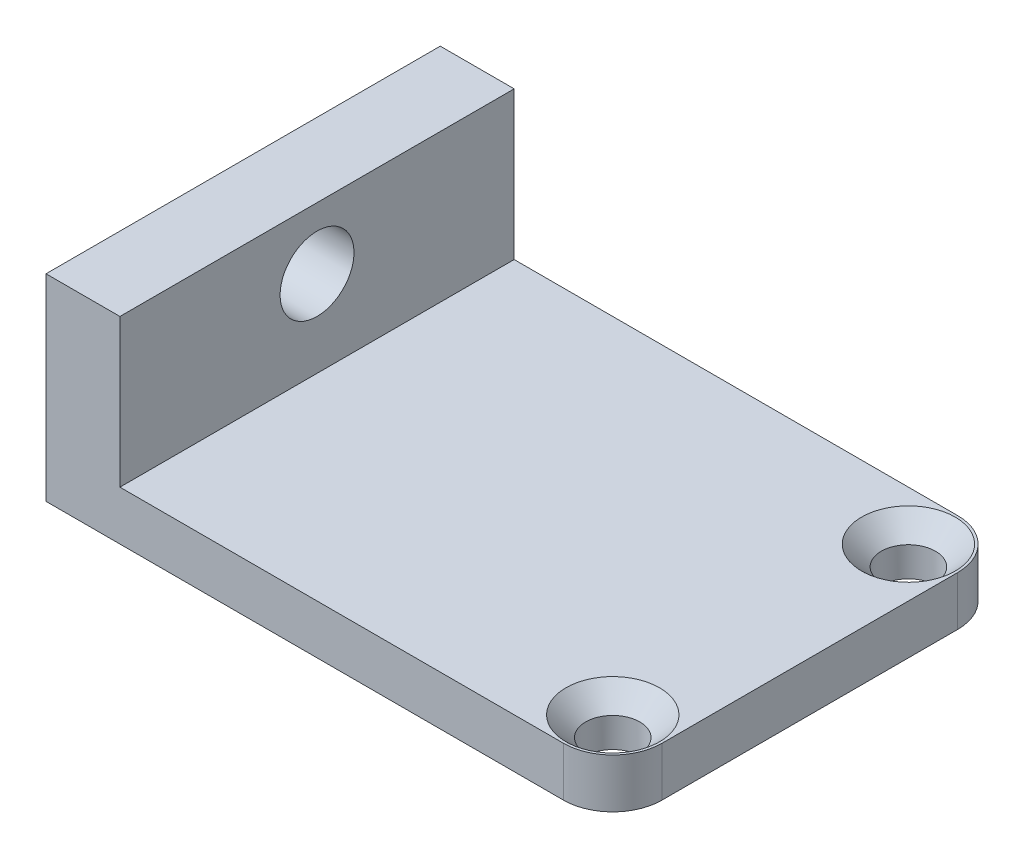
ISO-10303-21;
HEADER;
FILE_DESCRIPTION(('STEP AP214'),'2;1');
FILE_NAME('part.step','',(''),(''),'','','');
FILE_SCHEMA(('AUTOMOTIVE_DESIGN { 1 0 10303 214 1 1 1 1 }'));
ENDSEC;
DATA;
#1=APPLICATION_CONTEXT('core data for automotive mechanical design processes');
#2=APPLICATION_PROTOCOL_DEFINITION('international standard','automotive_design',2000,#1);
#3=PRODUCT_CONTEXT('',#1,'mechanical');
#4=PRODUCT('Part','Part','',(#3));
#5=PRODUCT_RELATED_PRODUCT_CATEGORY('part','',(#4));
#6=PRODUCT_DEFINITION_FORMATION('','',#4);
#7=PRODUCT_DEFINITION_CONTEXT('part definition',#1,'design');
#8=PRODUCT_DEFINITION('design','',#6,#7);
#9=PRODUCT_DEFINITION_SHAPE('','',#8);
#10=(LENGTH_UNIT() NAMED_UNIT(*) SI_UNIT(.MILLI.,.METRE.));
#11=(NAMED_UNIT(*) PLANE_ANGLE_UNIT() SI_UNIT($,.RADIAN.));
#12=(NAMED_UNIT(*) SI_UNIT($,.STERADIAN.) SOLID_ANGLE_UNIT());
#13=UNCERTAINTY_MEASURE_WITH_UNIT(LENGTH_MEASURE(1.E-05),#10,'distance_accuracy_value','');
#14=(GEOMETRIC_REPRESENTATION_CONTEXT(3) GLOBAL_UNCERTAINTY_ASSIGNED_CONTEXT((#13)) GLOBAL_UNIT_ASSIGNED_CONTEXT((#10,
#11,#12)) REPRESENTATION_CONTEXT('',''));
#15=CARTESIAN_POINT('',(0.,0.,0.));
#16=DIRECTION('',(0.,0.,1.));
#17=DIRECTION('',(1.,0.,0.));
#18=AXIS2_PLACEMENT_3D('',#15,#16,#17);
#19=CARTESIAN_POINT('',(23.,0.,16.));
#20=DIRECTION('',(0.,1.,0.));
#21=DIRECTION('',(0.,0.,1.));
#22=AXIS2_PLACEMENT_3D('',#19,#20,#21);
#23=PLANE('',#22);
#24=CARTESIAN_POINT('',(21.,0.,2.));
#25=DIRECTION('',(0.,1.,0.));
#26=DIRECTION('',(0.,0.,1.));
#27=AXIS2_PLACEMENT_3D('',#24,#25,#26);
#28=CIRCLE('',#27,1.1);
#29=CARTESIAN_POINT('',(21.,0.,3.1));
#30=VERTEX_POINT('',#29);
#31=EDGE_CURVE('E133',#30,#30,#28,.T.);
#32=ORIENTED_EDGE('',*,*,#31,.T.);
#33=EDGE_LOOP('',(#32));
#34=FACE_BOUND('',#33,.T.);
#35=CARTESIAN_POINT('',(21.,0.,14.));
#36=DIRECTION('',(0.,1.,0.));
#37=DIRECTION('',(0.,0.,1.));
#38=AXIS2_PLACEMENT_3D('',#35,#36,#37);
#39=CIRCLE('',#38,1.1);
#40=CARTESIAN_POINT('',(21.,0.,15.1));
#41=VERTEX_POINT('',#40);
#42=EDGE_CURVE('E332',#41,#41,#39,.T.);
#43=ORIENTED_EDGE('',*,*,#42,.T.);
#44=EDGE_LOOP('',(#43));
#45=FACE_BOUND('',#44,.T.);
#46=DIRECTION('',(0.,0.,-1.));
#47=VECTOR('',#46,1.);
#48=CARTESIAN_POINT('',(23.,0.,16.));
#49=LINE('',#48,#47);
#50=CARTESIAN_POINT('',(23.,0.,14.));
#51=VERTEX_POINT('',#50);
#52=CARTESIAN_POINT('',(23.,0.,2.));
#53=VERTEX_POINT('',#52);
#54=EDGE_CURVE('E149',#51,#53,#49,.T.);
#55=ORIENTED_EDGE('',*,*,#54,.F.);
#56=CARTESIAN_POINT('',(21.,0.,14.));
#57=DIRECTION('',(0.,1.,0.));
#58=DIRECTION('',(0.,0.,1.));
#59=AXIS2_PLACEMENT_3D('',#56,#57,#58);
#60=CIRCLE('',#59,2.);
#61=CARTESIAN_POINT('',(21.,0.,16.));
#62=VERTEX_POINT('',#61);
#63=EDGE_CURVE('E41',#51,#62,#60,.F.);
#64=ORIENTED_EDGE('',*,*,#63,.T.);
#65=DIRECTION('',(1.,0.,0.));
#66=VECTOR('',#65,1.);
#67=CARTESIAN_POINT('',(23.,0.,16.));
#68=LINE('',#67,#66);
#69=CARTESIAN_POINT('',(0.,0.,16.));
#70=VERTEX_POINT('',#69);
#71=EDGE_CURVE('E109',#70,#62,#68,.T.);
#72=ORIENTED_EDGE('',*,*,#71,.F.);
#73=DIRECTION('',(0.,0.,-1.));
#74=VECTOR('',#73,1.);
#75=CARTESIAN_POINT('',(0.,0.,16.));
#76=LINE('',#75,#74);
#77=CARTESIAN_POINT('',(0.,0.,0.));
#78=VERTEX_POINT('',#77);
#79=EDGE_CURVE('E130',#70,#78,#76,.T.);
#80=ORIENTED_EDGE('',*,*,#79,.T.);
#81=DIRECTION('',(1.,0.,0.));
#82=VECTOR('',#81,1.);
#83=CARTESIAN_POINT('',(23.,0.,0.));
#84=LINE('',#83,#82);
#85=CARTESIAN_POINT('',(21.,0.,0.));
#86=VERTEX_POINT('',#85);
#87=EDGE_CURVE('E131',#78,#86,#84,.T.);
#88=ORIENTED_EDGE('',*,*,#87,.T.);
#89=CARTESIAN_POINT('',(21.,0.,2.));
#90=DIRECTION('',(0.,1.,0.));
#91=DIRECTION('',(0.,0.,1.));
#92=AXIS2_PLACEMENT_3D('',#89,#90,#91);
#93=CIRCLE('',#92,2.);
#94=EDGE_CURVE('E53',#86,#53,#93,.F.);
#95=ORIENTED_EDGE('',*,*,#94,.T.);
#96=EDGE_LOOP('',(#55,#64,#72,#80,#88,#95));
#97=FACE_BOUND('',#96,.T.);
#98=ADVANCED_FACE('F33',(#34,#45,#97),#23,.F.);
#99=CARTESIAN_POINT('',(23.,2.,16.));
#100=DIRECTION('',(-1.,0.,0.));
#101=DIRECTION('',(0.,0.,1.));
#102=AXIS2_PLACEMENT_3D('',#99,#100,#101);
#103=PLANE('',#102);
#104=DIRECTION('',(0.,0.,-1.));
#105=VECTOR('',#104,1.);
#106=CARTESIAN_POINT('',(23.,2.,16.));
#107=LINE('',#106,#105);
#108=CARTESIAN_POINT('',(23.,2.,14.));
#109=VERTEX_POINT('',#108);
#110=CARTESIAN_POINT('',(23.,2.,2.));
#111=VERTEX_POINT('',#110);
#112=EDGE_CURVE('E117',#109,#111,#107,.T.);
#113=ORIENTED_EDGE('',*,*,#112,.F.);
#114=DIRECTION('',(0.,1.,0.));
#115=VECTOR('',#114,1.);
#116=CARTESIAN_POINT('',(23.,2.,14.));
#117=LINE('',#116,#115);
#118=EDGE_CURVE('E171',#109,#51,#117,.F.);
#119=ORIENTED_EDGE('',*,*,#118,.T.);
#120=ORIENTED_EDGE('',*,*,#54,.T.);
#121=DIRECTION('',(0.,1.,0.));
#122=VECTOR('',#121,1.);
#123=CARTESIAN_POINT('',(23.,2.,2.));
#124=LINE('',#123,#122);
#125=EDGE_CURVE('E168',#53,#111,#124,.T.);
#126=ORIENTED_EDGE('',*,*,#125,.T.);
#127=EDGE_LOOP('',(#113,#119,#120,#126));
#128=FACE_BOUND('',#127,.T.);
#129=ADVANCED_FACE('F182',(#128),#103,.F.);
#130=CARTESIAN_POINT('',(3.,2.,16.));
#131=DIRECTION('',(0.,-1.,0.));
#132=DIRECTION('',(0.,0.,-1.));
#133=AXIS2_PLACEMENT_3D('',#130,#131,#132);
#134=PLANE('',#133);
#135=CARTESIAN_POINT('',(21.,2.,14.));
#136=DIRECTION('',(0.,-1.,0.));
#137=DIRECTION('',(0.,0.,-1.));
#138=AXIS2_PLACEMENT_3D('',#135,#136,#137);
#139=CIRCLE('',#138,1.9);
#140=CARTESIAN_POINT('',(21.,2.,12.1));
#141=VERTEX_POINT('',#140);
#142=EDGE_CURVE('E157',#141,#141,#139,.T.);
#143=ORIENTED_EDGE('',*,*,#142,.T.);
#144=EDGE_LOOP('',(#143));
#145=FACE_BOUND('',#144,.T.);
#146=CARTESIAN_POINT('',(21.,2.,2.));
#147=DIRECTION('',(0.,-1.,0.));
#148=DIRECTION('',(0.,0.,-1.));
#149=AXIS2_PLACEMENT_3D('',#146,#147,#148);
#150=CIRCLE('',#149,1.9);
#151=CARTESIAN_POINT('',(21.,2.,0.100000000000001));
#152=VERTEX_POINT('',#151);
#153=EDGE_CURVE('E154',#152,#152,#150,.T.);
#154=ORIENTED_EDGE('',*,*,#153,.T.);
#155=EDGE_LOOP('',(#154));
#156=FACE_BOUND('',#155,.T.);
#157=DIRECTION('',(-1.,0.,0.));
#158=VECTOR('',#157,1.);
#159=CARTESIAN_POINT('',(3.,2.,16.));
#160=LINE('',#159,#158);
#161=CARTESIAN_POINT('',(21.,2.,16.));
#162=VERTEX_POINT('',#161);
#163=CARTESIAN_POINT('',(3.,2.,16.));
#164=VERTEX_POINT('',#163);
#165=EDGE_CURVE('E99',#162,#164,#160,.T.);
#166=ORIENTED_EDGE('',*,*,#165,.F.);
#167=CARTESIAN_POINT('',(21.,2.,14.));
#168=DIRECTION('',(0.,-1.,0.));
#169=DIRECTION('',(0.,0.,-1.));
#170=AXIS2_PLACEMENT_3D('',#167,#168,#169);
#171=CIRCLE('',#170,2.);
#172=EDGE_CURVE('E166',#162,#109,#171,.F.);
#173=ORIENTED_EDGE('',*,*,#172,.T.);
#174=ORIENTED_EDGE('',*,*,#112,.T.);
#175=CARTESIAN_POINT('',(21.,2.,2.));
#176=DIRECTION('',(0.,-1.,0.));
#177=DIRECTION('',(0.,0.,-1.));
#178=AXIS2_PLACEMENT_3D('',#175,#176,#177);
#179=CIRCLE('',#178,2.);
#180=CARTESIAN_POINT('',(21.,2.,0.));
#181=VERTEX_POINT('',#180);
#182=EDGE_CURVE('E164',#111,#181,#179,.F.);
#183=ORIENTED_EDGE('',*,*,#182,.T.);
#184=DIRECTION('',(-1.,0.,0.));
#185=VECTOR('',#184,1.);
#186=CARTESIAN_POINT('',(3.,2.,0.));
#187=LINE('',#186,#185);
#188=CARTESIAN_POINT('',(3.,2.,0.));
#189=VERTEX_POINT('',#188);
#190=EDGE_CURVE('E114',#181,#189,#187,.T.);
#191=ORIENTED_EDGE('',*,*,#190,.T.);
#192=DIRECTION('',(0.,0.,-1.));
#193=VECTOR('',#192,1.);
#194=CARTESIAN_POINT('',(3.,2.,16.));
#195=LINE('',#194,#193);
#196=EDGE_CURVE('E112',#164,#189,#195,.T.);
#197=ORIENTED_EDGE('',*,*,#196,.F.);
#198=EDGE_LOOP('',(#166,#173,#174,#183,#191,#197));
#199=FACE_BOUND('',#198,.T.);
#200=ADVANCED_FACE('F113',(#145,#156,#199),#134,.F.);
#201=CARTESIAN_POINT('',(3.,8.,16.));
#202=DIRECTION('',(-1.,0.,0.));
#203=DIRECTION('',(0.,-1.,0.));
#204=AXIS2_PLACEMENT_3D('',#201,#202,#203);
#205=PLANE('',#204);
#206=CARTESIAN_POINT('',(3.,5.5,8.));
#207=DIRECTION('',(-1.,0.,0.));
#208=DIRECTION('',(0.,-1.,0.));
#209=AXIS2_PLACEMENT_3D('',#206,#207,#208);
#210=CIRCLE('',#209,1.5);
#211=CARTESIAN_POINT('',(3.,4.,8.));
#212=VERTEX_POINT('',#211);
#213=EDGE_CURVE('E330',#212,#212,#210,.T.);
#214=ORIENTED_EDGE('',*,*,#213,.T.);
#215=EDGE_LOOP('',(#214));
#216=FACE_BOUND('',#215,.T.);
#217=DIRECTION('',(0.,1.,0.));
#218=VECTOR('',#217,1.);
#219=CARTESIAN_POINT('',(3.,8.,0.));
#220=LINE('',#219,#218);
#221=CARTESIAN_POINT('',(3.,8.,0.));
#222=VERTEX_POINT('',#221);
#223=EDGE_CURVE('E135',#189,#222,#220,.T.);
#224=ORIENTED_EDGE('',*,*,#223,.T.);
#225=DIRECTION('',(0.,0.,-1.));
#226=VECTOR('',#225,1.);
#227=CARTESIAN_POINT('',(3.,8.,16.));
#228=LINE('',#227,#226);
#229=CARTESIAN_POINT('',(3.,8.,16.));
#230=VERTEX_POINT('',#229);
#231=EDGE_CURVE('E118',#230,#222,#228,.T.);
#232=ORIENTED_EDGE('',*,*,#231,.F.);
#233=DIRECTION('',(0.,1.,0.));
#234=VECTOR('',#233,1.);
#235=CARTESIAN_POINT('',(3.,8.,16.));
#236=LINE('',#235,#234);
#237=EDGE_CURVE('E104',#164,#230,#236,.T.);
#238=ORIENTED_EDGE('',*,*,#237,.F.);
#239=ORIENTED_EDGE('',*,*,#196,.T.);
#240=EDGE_LOOP('',(#224,#232,#238,#239));
#241=FACE_BOUND('',#240,.T.);
#242=ADVANCED_FACE('F120',(#216,#241),#205,.F.);
#243=CARTESIAN_POINT('',(0.,8.,16.));
#244=DIRECTION('',(0.,-1.,0.));
#245=DIRECTION('',(0.,0.,-1.));
#246=AXIS2_PLACEMENT_3D('',#243,#244,#245);
#247=PLANE('',#246);
#248=DIRECTION('',(-1.,0.,0.));
#249=VECTOR('',#248,1.);
#250=CARTESIAN_POINT('',(0.,8.,0.));
#251=LINE('',#250,#249);
#252=CARTESIAN_POINT('',(0.,8.,0.));
#253=VERTEX_POINT('',#252);
#254=EDGE_CURVE('E137',#222,#253,#251,.T.);
#255=ORIENTED_EDGE('',*,*,#254,.T.);
#256=DIRECTION('',(0.,0.,-1.));
#257=VECTOR('',#256,1.);
#258=CARTESIAN_POINT('',(0.,8.,16.));
#259=LINE('',#258,#257);
#260=CARTESIAN_POINT('',(0.,8.,16.));
#261=VERTEX_POINT('',#260);
#262=EDGE_CURVE('E143',#261,#253,#259,.T.);
#263=ORIENTED_EDGE('',*,*,#262,.F.);
#264=DIRECTION('',(-1.,0.,0.));
#265=VECTOR('',#264,1.);
#266=CARTESIAN_POINT('',(0.,8.,16.));
#267=LINE('',#266,#265);
#268=EDGE_CURVE('E123',#230,#261,#267,.T.);
#269=ORIENTED_EDGE('',*,*,#268,.F.);
#270=ORIENTED_EDGE('',*,*,#231,.T.);
#271=EDGE_LOOP('',(#255,#263,#269,#270));
#272=FACE_BOUND('',#271,.T.);
#273=ADVANCED_FACE('F189',(#272),#247,.F.);
#274=CARTESIAN_POINT('',(0.,0.,16.));
#275=DIRECTION('',(1.,0.,0.));
#276=DIRECTION('',(0.,0.,-1.));
#277=AXIS2_PLACEMENT_3D('',#274,#275,#276);
#278=PLANE('',#277);
#279=CARTESIAN_POINT('',(0.,5.5,8.));
#280=DIRECTION('',(-1.,0.,0.));
#281=DIRECTION('',(0.,0.,1.));
#282=AXIS2_PLACEMENT_3D('',#279,#280,#281);
#283=CIRCLE('',#282,1.5);
#284=CARTESIAN_POINT('',(0.,5.5,9.5));
#285=VERTEX_POINT('',#284);
#286=EDGE_CURVE('E333',#285,#285,#283,.T.);
#287=ORIENTED_EDGE('',*,*,#286,.F.);
#288=EDGE_LOOP('',(#287));
#289=FACE_BOUND('',#288,.T.);
#290=DIRECTION('',(0.,-1.,0.));
#291=VECTOR('',#290,1.);
#292=CARTESIAN_POINT('',(0.,0.,0.));
#293=LINE('',#292,#291);
#294=EDGE_CURVE('E139',#253,#78,#293,.T.);
#295=ORIENTED_EDGE('',*,*,#294,.T.);
#296=ORIENTED_EDGE('',*,*,#79,.F.);
#297=DIRECTION('',(0.,-1.,0.));
#298=VECTOR('',#297,1.);
#299=CARTESIAN_POINT('',(0.,0.,16.));
#300=LINE('',#299,#298);
#301=EDGE_CURVE('E125',#261,#70,#300,.T.);
#302=ORIENTED_EDGE('',*,*,#301,.F.);
#303=ORIENTED_EDGE('',*,*,#262,.T.);
#304=EDGE_LOOP('',(#295,#296,#302,#303));
#305=FACE_BOUND('',#304,.T.);
#306=ADVANCED_FACE('F192',(#289,#305),#278,.F.);
#307=CARTESIAN_POINT('',(0.,0.,16.));
#308=DIRECTION('',(0.,0.,-1.));
#309=DIRECTION('',(-1.,0.,0.));
#310=AXIS2_PLACEMENT_3D('',#307,#308,#309);
#311=PLANE('',#310);
#312=ORIENTED_EDGE('',*,*,#71,.T.);
#313=DIRECTION('',(0.,1.,0.));
#314=VECTOR('',#313,1.);
#315=CARTESIAN_POINT('',(21.,0.,16.));
#316=LINE('',#315,#314);
#317=EDGE_CURVE('E107',#62,#162,#316,.T.);
#318=ORIENTED_EDGE('',*,*,#317,.T.);
#319=ORIENTED_EDGE('',*,*,#165,.T.);
#320=ORIENTED_EDGE('',*,*,#237,.T.);
#321=ORIENTED_EDGE('',*,*,#268,.T.);
#322=ORIENTED_EDGE('',*,*,#301,.T.);
#323=EDGE_LOOP('',(#312,#318,#319,#320,#321,#322));
#324=FACE_BOUND('',#323,.T.);
#325=ADVANCED_FACE('F102',(#324),#311,.F.);
#326=CARTESIAN_POINT('',(0.,0.,0.));
#327=DIRECTION('',(0.,0.,-1.));
#328=DIRECTION('',(-1.,0.,0.));
#329=AXIS2_PLACEMENT_3D('',#326,#327,#328);
#330=PLANE('',#329);
#331=ORIENTED_EDGE('',*,*,#190,.F.);
#332=DIRECTION('',(0.,1.,0.));
#333=VECTOR('',#332,1.);
#334=CARTESIAN_POINT('',(21.,0.,0.));
#335=LINE('',#334,#333);
#336=EDGE_CURVE('E11',#181,#86,#335,.F.);
#337=ORIENTED_EDGE('',*,*,#336,.T.);
#338=ORIENTED_EDGE('',*,*,#87,.F.);
#339=ORIENTED_EDGE('',*,*,#294,.F.);
#340=ORIENTED_EDGE('',*,*,#254,.F.);
#341=ORIENTED_EDGE('',*,*,#223,.F.);
#342=EDGE_LOOP('',(#331,#337,#338,#339,#340,#341));
#343=FACE_BOUND('',#342,.T.);
#344=ADVANCED_FACE('F185',(#343),#330,.T.);
#345=CARTESIAN_POINT('',(21.,0.,14.));
#346=DIRECTION('',(0.,1.,0.));
#347=DIRECTION('',(0.,0.,1.));
#348=AXIS2_PLACEMENT_3D('',#345,#346,#347);
#349=CYLINDRICAL_SURFACE('',#348,1.1);
#350=CARTESIAN_POINT('',(21.,1.2,14.));
#351=DIRECTION('',(0.,-1.,0.));
#352=DIRECTION('',(0.,0.,-1.));
#353=AXIS2_PLACEMENT_3D('',#350,#351,#352);
#354=CIRCLE('',#353,1.1);
#355=CARTESIAN_POINT('',(21.,1.2,12.9));
#356=VERTEX_POINT('',#355);
#357=EDGE_CURVE('E151',#356,#356,#354,.F.);
#358=ORIENTED_EDGE('',*,*,#357,.T.);
#359=EDGE_LOOP('',(#358));
#360=FACE_BOUND('',#359,.T.);
#361=ORIENTED_EDGE('',*,*,#42,.F.);
#362=EDGE_LOOP('',(#361));
#363=FACE_BOUND('',#362,.T.);
#364=ADVANCED_FACE('F243',(#360,#363),#349,.F.);
#365=CARTESIAN_POINT('',(21.,0.,2.));
#366=DIRECTION('',(0.,1.,0.));
#367=DIRECTION('',(0.,0.,1.));
#368=AXIS2_PLACEMENT_3D('',#365,#366,#367);
#369=CYLINDRICAL_SURFACE('',#368,1.1);
#370=CARTESIAN_POINT('',(21.,1.2,2.));
#371=DIRECTION('',(0.,-1.,0.));
#372=DIRECTION('',(0.,0.,-1.));
#373=AXIS2_PLACEMENT_3D('',#370,#371,#372);
#374=CIRCLE('',#373,1.1);
#375=CARTESIAN_POINT('',(21.,1.2,0.900000000000001));
#376=VERTEX_POINT('',#375);
#377=EDGE_CURVE('E160',#376,#376,#374,.F.);
#378=ORIENTED_EDGE('',*,*,#377,.T.);
#379=EDGE_LOOP('',(#378));
#380=FACE_BOUND('',#379,.T.);
#381=ORIENTED_EDGE('',*,*,#31,.F.);
#382=EDGE_LOOP('',(#381));
#383=FACE_BOUND('',#382,.T.);
#384=ADVANCED_FACE('F289',(#380,#383),#369,.F.);
#385=CARTESIAN_POINT('',(23.,5.5,8.));
#386=DIRECTION('',(-1.,0.,0.));
#387=DIRECTION('',(0.,0.,1.));
#388=AXIS2_PLACEMENT_3D('',#385,#386,#387);
#389=CYLINDRICAL_SURFACE('',#388,1.5);
#390=ORIENTED_EDGE('',*,*,#286,.T.);
#391=EDGE_LOOP('',(#390));
#392=FACE_BOUND('',#391,.T.);
#393=ORIENTED_EDGE('',*,*,#213,.F.);
#394=EDGE_LOOP('',(#393));
#395=FACE_BOUND('',#394,.T.);
#396=ADVANCED_FACE('F219',(#392,#395),#389,.F.);
#397=CARTESIAN_POINT('',(21.,1.2,14.));
#398=DIRECTION('',(0.,1.,0.));
#399=DIRECTION('',(0.,0.,1.));
#400=AXIS2_PLACEMENT_3D('',#397,#398,#399);
#401=CONICAL_SURFACE('',#400,1.1,0.785398163397449);
#402=ORIENTED_EDGE('',*,*,#142,.F.);
#403=EDGE_LOOP('',(#402));
#404=FACE_BOUND('',#403,.T.);
#405=ORIENTED_EDGE('',*,*,#357,.F.);
#406=EDGE_LOOP('',(#405));
#407=FACE_BOUND('',#406,.T.);
#408=ADVANCED_FACE('F215',(#404,#407),#401,.F.);
#409=CARTESIAN_POINT('',(21.,1.2,2.));
#410=DIRECTION('',(0.,1.,0.));
#411=DIRECTION('',(0.,0.,1.));
#412=AXIS2_PLACEMENT_3D('',#409,#410,#411);
#413=CONICAL_SURFACE('',#412,1.1,0.785398163397448);
#414=ORIENTED_EDGE('',*,*,#153,.F.);
#415=EDGE_LOOP('',(#414));
#416=FACE_BOUND('',#415,.T.);
#417=ORIENTED_EDGE('',*,*,#377,.F.);
#418=EDGE_LOOP('',(#417));
#419=FACE_BOUND('',#418,.T.);
#420=ADVANCED_FACE('F218',(#416,#419),#413,.F.);
#421=CARTESIAN_POINT('',(21.,0.,14.));
#422=DIRECTION('',(0.,1.,0.));
#423=DIRECTION('',(0.,0.,1.));
#424=AXIS2_PLACEMENT_3D('',#421,#422,#423);
#425=CYLINDRICAL_SURFACE('',#424,2.);
#426=ORIENTED_EDGE('',*,*,#63,.F.);
#427=ORIENTED_EDGE('',*,*,#118,.F.);
#428=ORIENTED_EDGE('',*,*,#172,.F.);
#429=ORIENTED_EDGE('',*,*,#317,.F.);
#430=EDGE_LOOP('',(#426,#427,#428,#429));
#431=FACE_BOUND('',#430,.T.);
#432=ADVANCED_FACE('F179',(#431),#425,.T.);
#433=CARTESIAN_POINT('',(21.,2.,2.));
#434=DIRECTION('',(0.,-1.,0.));
#435=DIRECTION('',(0.,0.,-1.));
#436=AXIS2_PLACEMENT_3D('',#433,#434,#435);
#437=CYLINDRICAL_SURFACE('',#436,2.);
#438=ORIENTED_EDGE('',*,*,#94,.F.);
#439=ORIENTED_EDGE('',*,*,#336,.F.);
#440=ORIENTED_EDGE('',*,*,#182,.F.);
#441=ORIENTED_EDGE('',*,*,#125,.F.);
#442=EDGE_LOOP('',(#438,#439,#440,#441));
#443=FACE_BOUND('',#442,.T.);
#444=ADVANCED_FACE('F35',(#443),#437,.T.);
#445=CLOSED_SHELL('',(#98,#129,#200,#242,#273,#306,#325,#344,#364,#384,#396,#408,#420,#432,#444));
#446=MANIFOLD_SOLID_BREP('B2',#445);
#447=ADVANCED_BREP_SHAPE_REPRESENTATION('',(#18,#446),#14);
#448=SHAPE_DEFINITION_REPRESENTATION(#9,#447);
ENDSEC;
END-ISO-10303-21;
